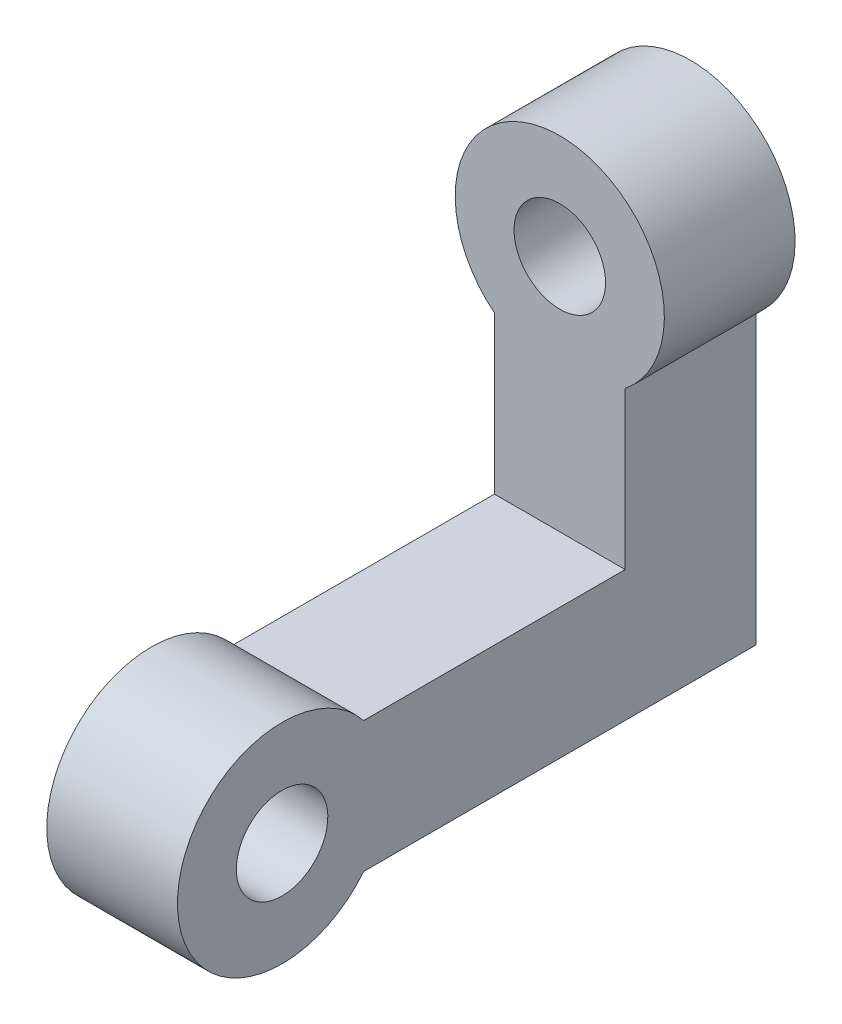
ISO-10303-21;
HEADER;
FILE_DESCRIPTION(('STEP AP214'),'2;1');
FILE_NAME('part.step','',(''),(''),'','','');
FILE_SCHEMA(('AUTOMOTIVE_DESIGN { 1 0 10303 214 1 1 1 1 }'));
ENDSEC;
DATA;
#1=APPLICATION_CONTEXT('core data for automotive mechanical design processes');
#2=APPLICATION_PROTOCOL_DEFINITION('international standard','automotive_design',2000,#1);
#3=PRODUCT_CONTEXT('',#1,'mechanical');
#4=PRODUCT('Part','Part','',(#3));
#5=PRODUCT_RELATED_PRODUCT_CATEGORY('part','',(#4));
#6=PRODUCT_DEFINITION_FORMATION('','',#4);
#7=PRODUCT_DEFINITION_CONTEXT('part definition',#1,'design');
#8=PRODUCT_DEFINITION('design','',#6,#7);
#9=PRODUCT_DEFINITION_SHAPE('','',#8);
#10=(LENGTH_UNIT() NAMED_UNIT(*) SI_UNIT(.MILLI.,.METRE.));
#11=(NAMED_UNIT(*) PLANE_ANGLE_UNIT() SI_UNIT($,.RADIAN.));
#12=(NAMED_UNIT(*) SI_UNIT($,.STERADIAN.) SOLID_ANGLE_UNIT());
#13=UNCERTAINTY_MEASURE_WITH_UNIT(LENGTH_MEASURE(1.E-05),#10,'distance_accuracy_value','');
#14=(GEOMETRIC_REPRESENTATION_CONTEXT(3) GLOBAL_UNCERTAINTY_ASSIGNED_CONTEXT((#13)) GLOBAL_UNIT_ASSIGNED_CONTEXT((#10,
#11,#12)) REPRESENTATION_CONTEXT('',''));
#15=CARTESIAN_POINT('',(0.,0.,0.));
#16=DIRECTION('',(0.,0.,1.));
#17=DIRECTION('',(1.,0.,0.));
#18=AXIS2_PLACEMENT_3D('',#15,#16,#17);
#19=CARTESIAN_POINT('',(0.,0.,5.));
#20=DIRECTION('',(0.,0.,1.));
#21=DIRECTION('',(1.,0.,0.));
#22=AXIS2_PLACEMENT_3D('',#19,#20,#21);
#23=PLANE('',#22);
#24=CARTESIAN_POINT('',(0.,0.,5.));
#25=DIRECTION('',(0.,0.,1.));
#26=DIRECTION('',(1.,0.,0.));
#27=AXIS2_PLACEMENT_3D('',#24,#25,#26);
#28=CIRCLE('',#27,4.);
#29=CARTESIAN_POINT('',(2.5,-3.1224989991992,5.));
#30=VERTEX_POINT('',#29);
#31=CARTESIAN_POINT('',(-2.5,-3.1224989991992,5.));
#32=VERTEX_POINT('',#31);
#33=EDGE_CURVE('E99',#30,#32,#28,.T.);
#34=ORIENTED_EDGE('',*,*,#33,.T.);
#35=DIRECTION('',(0.,-1.,0.));
#36=VECTOR('',#35,1.);
#37=CARTESIAN_POINT('',(-2.5,-3.1224989991992,5.));
#38=LINE('',#37,#36);
#39=CARTESIAN_POINT('',(-2.5,-9.1224989991992,5.));
#40=VERTEX_POINT('',#39);
#41=EDGE_CURVE('E137',#32,#40,#38,.T.);
#42=ORIENTED_EDGE('',*,*,#41,.T.);
#43=DIRECTION('',(1.,0.,0.));
#44=VECTOR('',#43,1.);
#45=CARTESIAN_POINT('',(-2.5,-9.1224989991992,5.));
#46=LINE('',#45,#44);
#47=CARTESIAN_POINT('',(2.5,-9.1224989991992,5.));
#48=VERTEX_POINT('',#47);
#49=EDGE_CURVE('E140',#40,#48,#46,.T.);
#50=ORIENTED_EDGE('',*,*,#49,.T.);
#51=DIRECTION('',(0.,1.,0.));
#52=VECTOR('',#51,1.);
#53=CARTESIAN_POINT('',(2.5,-3.1224989991992,5.));
#54=LINE('',#53,#52);
#55=EDGE_CURVE('E50',#48,#30,#54,.T.);
#56=ORIENTED_EDGE('',*,*,#55,.T.);
#57=EDGE_LOOP('',(#34,#42,#50,#56));
#58=FACE_BOUND('',#57,.T.);
#59=CARTESIAN_POINT('',(0.,0.,5.));
#60=DIRECTION('',(0.,0.,1.));
#61=DIRECTION('',(1.,0.,0.));
#62=AXIS2_PLACEMENT_3D('',#59,#60,#61);
#63=CIRCLE('',#62,1.75);
#64=CARTESIAN_POINT('',(1.75,0.,5.));
#65=VERTEX_POINT('',#64);
#66=EDGE_CURVE('E131',#65,#65,#63,.T.);
#67=ORIENTED_EDGE('',*,*,#66,.F.);
#68=EDGE_LOOP('',(#67));
#69=FACE_BOUND('',#68,.T.);
#70=ADVANCED_FACE('F33',(#58,#69),#23,.T.);
#71=CARTESIAN_POINT('',(0.,0.,0.));
#72=DIRECTION('',(0.,0.,1.));
#73=DIRECTION('',(1.,0.,0.));
#74=AXIS2_PLACEMENT_3D('',#71,#72,#73);
#75=PLANE('',#74);
#76=CARTESIAN_POINT('',(0.,0.,0.));
#77=DIRECTION('',(0.,0.,1.));
#78=DIRECTION('',(1.,0.,0.));
#79=AXIS2_PLACEMENT_3D('',#76,#77,#78);
#80=CIRCLE('',#79,4.);
#81=CARTESIAN_POINT('',(2.5,-3.1224989991992,0.));
#82=VERTEX_POINT('',#81);
#83=CARTESIAN_POINT('',(-2.5,-3.1224989991992,0.));
#84=VERTEX_POINT('',#83);
#85=EDGE_CURVE('E95',#82,#84,#80,.T.);
#86=ORIENTED_EDGE('',*,*,#85,.F.);
#87=DIRECTION('',(0.,1.,0.));
#88=VECTOR('',#87,1.);
#89=CARTESIAN_POINT('',(2.5,-3.1224989991992,0.));
#90=LINE('',#89,#88);
#91=CARTESIAN_POINT('',(2.5,-14.1224989991992,0.));
#92=VERTEX_POINT('',#91);
#93=EDGE_CURVE('E88',#92,#82,#90,.T.);
#94=ORIENTED_EDGE('',*,*,#93,.F.);
#95=DIRECTION('',(-1.,0.,0.));
#96=VECTOR('',#95,1.);
#97=CARTESIAN_POINT('',(2.5,-14.1224989991992,0.));
#98=LINE('',#97,#96);
#99=CARTESIAN_POINT('',(-2.5,-14.1224989991992,0.));
#100=VERTEX_POINT('',#99);
#101=EDGE_CURVE('E92',#92,#100,#98,.T.);
#102=ORIENTED_EDGE('',*,*,#101,.T.);
#103=DIRECTION('',(0.,-1.,0.));
#104=VECTOR('',#103,1.);
#105=CARTESIAN_POINT('',(-2.5,-3.1224989991992,0.));
#106=LINE('',#105,#104);
#107=EDGE_CURVE('E62',#84,#100,#106,.T.);
#108=ORIENTED_EDGE('',*,*,#107,.F.);
#109=EDGE_LOOP('',(#86,#94,#102,#108));
#110=FACE_BOUND('',#109,.T.);
#111=CARTESIAN_POINT('',(0.,0.,0.));
#112=DIRECTION('',(0.,0.,1.));
#113=DIRECTION('',(1.,0.,0.));
#114=AXIS2_PLACEMENT_3D('',#111,#112,#113);
#115=CIRCLE('',#114,1.75);
#116=CARTESIAN_POINT('',(1.75,0.,0.));
#117=VERTEX_POINT('',#116);
#118=EDGE_CURVE('E129',#117,#117,#115,.T.);
#119=ORIENTED_EDGE('',*,*,#118,.T.);
#120=EDGE_LOOP('',(#119));
#121=FACE_BOUND('',#120,.T.);
#122=ADVANCED_FACE('F90',(#110,#121),#75,.F.);
#123=CARTESIAN_POINT('',(0.,0.,5.));
#124=DIRECTION('',(0.,0.,-1.));
#125=DIRECTION('',(-1.,0.,0.));
#126=AXIS2_PLACEMENT_3D('',#123,#124,#125);
#127=CYLINDRICAL_SURFACE('',#126,4.);
#128=ORIENTED_EDGE('',*,*,#85,.T.);
#129=DIRECTION('',(0.,0.,-1.));
#130=VECTOR('',#129,1.);
#131=CARTESIAN_POINT('',(-2.5,-3.1224989991992,5.));
#132=LINE('',#131,#130);
#133=EDGE_CURVE('E11',#32,#84,#132,.T.);
#134=ORIENTED_EDGE('',*,*,#133,.F.);
#135=ORIENTED_EDGE('',*,*,#33,.F.);
#136=DIRECTION('',(0.,0.,-1.));
#137=VECTOR('',#136,1.);
#138=CARTESIAN_POINT('',(2.5,-3.1224989991992,5.));
#139=LINE('',#138,#137);
#140=EDGE_CURVE('E42',#30,#82,#139,.T.);
#141=ORIENTED_EDGE('',*,*,#140,.T.);
#142=EDGE_LOOP('',(#128,#134,#135,#141));
#143=FACE_BOUND('',#142,.T.);
#144=ADVANCED_FACE('F35',(#143),#127,.T.);
#145=CARTESIAN_POINT('',(-2.5,-3.1224989991992,5.));
#146=DIRECTION('',(1.,0.,0.));
#147=DIRECTION('',(0.,1.,0.));
#148=AXIS2_PLACEMENT_3D('',#145,#146,#147);
#149=PLANE('',#148);
#150=ORIENTED_EDGE('',*,*,#107,.T.);
#151=DIRECTION('',(0.,0.,1.));
#152=VECTOR('',#151,1.);
#153=CARTESIAN_POINT('',(-2.5,-14.1224989991992,0.));
#154=LINE('',#153,#152);
#155=CARTESIAN_POINT('',(-2.5,-14.1224989991992,15.));
#156=VERTEX_POINT('',#155);
#157=EDGE_CURVE('E107',#100,#156,#154,.T.);
#158=ORIENTED_EDGE('',*,*,#157,.T.);
#159=CARTESIAN_POINT('',(-2.5,-11.6224989991992,18.1224989991992));
#160=DIRECTION('',(-1.,0.,0.));
#161=DIRECTION('',(0.,-1.,0.));
#162=AXIS2_PLACEMENT_3D('',#159,#160,#161);
#163=CIRCLE('',#162,4.);
#164=CARTESIAN_POINT('',(-2.5,-9.1224989991992,15.));
#165=VERTEX_POINT('',#164);
#166=EDGE_CURVE('E116',#156,#165,#163,.T.);
#167=ORIENTED_EDGE('',*,*,#166,.T.);
#168=DIRECTION('',(0.,0.,-1.));
#169=VECTOR('',#168,1.);
#170=CARTESIAN_POINT('',(-2.5,-9.1224989991992,15.));
#171=LINE('',#170,#169);
#172=EDGE_CURVE('E120',#165,#40,#171,.T.);
#173=ORIENTED_EDGE('',*,*,#172,.T.);
#174=ORIENTED_EDGE('',*,*,#41,.F.);
#175=ORIENTED_EDGE('',*,*,#133,.T.);
#176=EDGE_LOOP('',(#150,#158,#167,#173,#174,#175));
#177=FACE_BOUND('',#176,.T.);
#178=CARTESIAN_POINT('',(-2.5,-11.6224989991992,18.1224989991992));
#179=DIRECTION('',(-1.,0.,0.));
#180=DIRECTION('',(0.,-1.,0.));
#181=AXIS2_PLACEMENT_3D('',#178,#179,#180);
#182=CIRCLE('',#181,1.75);
#183=CARTESIAN_POINT('',(-2.5,-13.3724989991992,18.1224989991992));
#184=VERTEX_POINT('',#183);
#185=EDGE_CURVE('E255',#184,#184,#182,.T.);
#186=ORIENTED_EDGE('',*,*,#185,.F.);
#187=EDGE_LOOP('',(#186));
#188=FACE_BOUND('',#187,.T.);
#189=ADVANCED_FACE('F152',(#177,#188),#149,.F.);
#190=CARTESIAN_POINT('',(2.5,-3.1224989991992,5.));
#191=DIRECTION('',(-1.,0.,0.));
#192=DIRECTION('',(0.,0.,1.));
#193=AXIS2_PLACEMENT_3D('',#190,#191,#192);
#194=PLANE('',#193);
#195=ORIENTED_EDGE('',*,*,#93,.T.);
#196=ORIENTED_EDGE('',*,*,#140,.F.);
#197=ORIENTED_EDGE('',*,*,#55,.F.);
#198=DIRECTION('',(0.,0.,-1.));
#199=VECTOR('',#198,1.);
#200=CARTESIAN_POINT('',(2.5,-9.1224989991992,15.));
#201=LINE('',#200,#199);
#202=CARTESIAN_POINT('',(2.5,-9.1224989991992,15.));
#203=VERTEX_POINT('',#202);
#204=EDGE_CURVE('E70',#203,#48,#201,.T.);
#205=ORIENTED_EDGE('',*,*,#204,.F.);
#206=CARTESIAN_POINT('',(2.5,-11.6224989991992,18.1224989991992));
#207=DIRECTION('',(-1.,0.,0.));
#208=DIRECTION('',(0.,-1.,0.));
#209=AXIS2_PLACEMENT_3D('',#206,#207,#208);
#210=CIRCLE('',#209,4.);
#211=CARTESIAN_POINT('',(2.5,-14.1224989991992,15.));
#212=VERTEX_POINT('',#211);
#213=EDGE_CURVE('E109',#212,#203,#210,.T.);
#214=ORIENTED_EDGE('',*,*,#213,.F.);
#215=DIRECTION('',(0.,0.,1.));
#216=VECTOR('',#215,1.);
#217=CARTESIAN_POINT('',(2.5,-14.1224989991992,0.));
#218=LINE('',#217,#216);
#219=EDGE_CURVE('E104',#92,#212,#218,.T.);
#220=ORIENTED_EDGE('',*,*,#219,.F.);
#221=EDGE_LOOP('',(#195,#196,#197,#205,#214,#220));
#222=FACE_BOUND('',#221,.T.);
#223=CARTESIAN_POINT('',(2.5,-11.6224989991992,18.1224989991992));
#224=DIRECTION('',(-1.,0.,0.));
#225=DIRECTION('',(0.,-1.,0.));
#226=AXIS2_PLACEMENT_3D('',#223,#224,#225);
#227=CIRCLE('',#226,1.75);
#228=CARTESIAN_POINT('',(2.5,-13.3724989991992,18.1224989991992));
#229=VERTEX_POINT('',#228);
#230=EDGE_CURVE('E123',#229,#229,#227,.T.);
#231=ORIENTED_EDGE('',*,*,#230,.T.);
#232=EDGE_LOOP('',(#231));
#233=FACE_BOUND('',#232,.T.);
#234=ADVANCED_FACE('F111',(#222,#233),#194,.F.);
#235=CARTESIAN_POINT('',(0.,0.,5.));
#236=DIRECTION('',(0.,0.,-1.));
#237=DIRECTION('',(-1.,0.,0.));
#238=AXIS2_PLACEMENT_3D('',#235,#236,#237);
#239=CYLINDRICAL_SURFACE('',#238,1.75);
#240=ORIENTED_EDGE('',*,*,#66,.T.);
#241=EDGE_LOOP('',(#240));
#242=FACE_BOUND('',#241,.T.);
#243=ORIENTED_EDGE('',*,*,#118,.F.);
#244=EDGE_LOOP('',(#243));
#245=FACE_BOUND('',#244,.T.);
#246=ADVANCED_FACE('F159',(#242,#245),#239,.F.);
#247=CARTESIAN_POINT('',(2.5,-9.1224989991992,15.));
#248=DIRECTION('',(0.,1.,0.));
#249=DIRECTION('',(-1.,0.,0.));
#250=AXIS2_PLACEMENT_3D('',#247,#248,#249);
#251=PLANE('',#250);
#252=ORIENTED_EDGE('',*,*,#204,.T.);
#253=ORIENTED_EDGE('',*,*,#49,.F.);
#254=ORIENTED_EDGE('',*,*,#172,.F.);
#255=DIRECTION('',(-1.,0.,0.));
#256=VECTOR('',#255,1.);
#257=CARTESIAN_POINT('',(2.5,-9.1224989991992,15.));
#258=LINE('',#257,#256);
#259=EDGE_CURVE('E127',#203,#165,#258,.T.);
#260=ORIENTED_EDGE('',*,*,#259,.F.);
#261=EDGE_LOOP('',(#252,#253,#254,#260));
#262=FACE_BOUND('',#261,.T.);
#263=ADVANCED_FACE('F162',(#262),#251,.T.);
#264=CARTESIAN_POINT('',(2.5,-11.6224989991992,18.1224989991992));
#265=DIRECTION('',(-1.,0.,0.));
#266=DIRECTION('',(0.,-1.,0.));
#267=AXIS2_PLACEMENT_3D('',#264,#265,#266);
#268=CYLINDRICAL_SURFACE('',#267,4.);
#269=ORIENTED_EDGE('',*,*,#166,.F.);
#270=DIRECTION('',(-1.,0.,0.));
#271=VECTOR('',#270,1.);
#272=CARTESIAN_POINT('',(2.5,-14.1224989991992,15.));
#273=LINE('',#272,#271);
#274=EDGE_CURVE('E108',#212,#156,#273,.T.);
#275=ORIENTED_EDGE('',*,*,#274,.F.);
#276=ORIENTED_EDGE('',*,*,#213,.T.);
#277=ORIENTED_EDGE('',*,*,#259,.T.);
#278=EDGE_LOOP('',(#269,#275,#276,#277));
#279=FACE_BOUND('',#278,.T.);
#280=ADVANCED_FACE('F149',(#279),#268,.T.);
#281=CARTESIAN_POINT('',(2.5,-14.1224989991992,0.));
#282=DIRECTION('',(0.,-1.,0.));
#283=DIRECTION('',(1.,0.,0.));
#284=AXIS2_PLACEMENT_3D('',#281,#282,#283);
#285=PLANE('',#284);
#286=ORIENTED_EDGE('',*,*,#157,.F.);
#287=ORIENTED_EDGE('',*,*,#101,.F.);
#288=ORIENTED_EDGE('',*,*,#219,.T.);
#289=ORIENTED_EDGE('',*,*,#274,.T.);
#290=EDGE_LOOP('',(#286,#287,#288,#289));
#291=FACE_BOUND('',#290,.T.);
#292=ADVANCED_FACE('F103',(#291),#285,.T.);
#293=CARTESIAN_POINT('',(2.5,-11.6224989991992,18.1224989991992));
#294=DIRECTION('',(-1.,0.,0.));
#295=DIRECTION('',(0.,-1.,0.));
#296=AXIS2_PLACEMENT_3D('',#293,#294,#295);
#297=CYLINDRICAL_SURFACE('',#296,1.75);
#298=ORIENTED_EDGE('',*,*,#230,.F.);
#299=EDGE_LOOP('',(#298));
#300=FACE_BOUND('',#299,.T.);
#301=ORIENTED_EDGE('',*,*,#185,.T.);
#302=EDGE_LOOP('',(#301));
#303=FACE_BOUND('',#302,.T.);
#304=ADVANCED_FACE('F204',(#300,#303),#297,.F.);
#305=CLOSED_SHELL('',(#70,#122,#144,#189,#234,#246,#263,#280,#292,#304));
#306=MANIFOLD_SOLID_BREP('B2',#305);
#307=ADVANCED_BREP_SHAPE_REPRESENTATION('',(#18,#306),#14);
#308=SHAPE_DEFINITION_REPRESENTATION(#9,#307);
ENDSEC;
END-ISO-10303-21;
